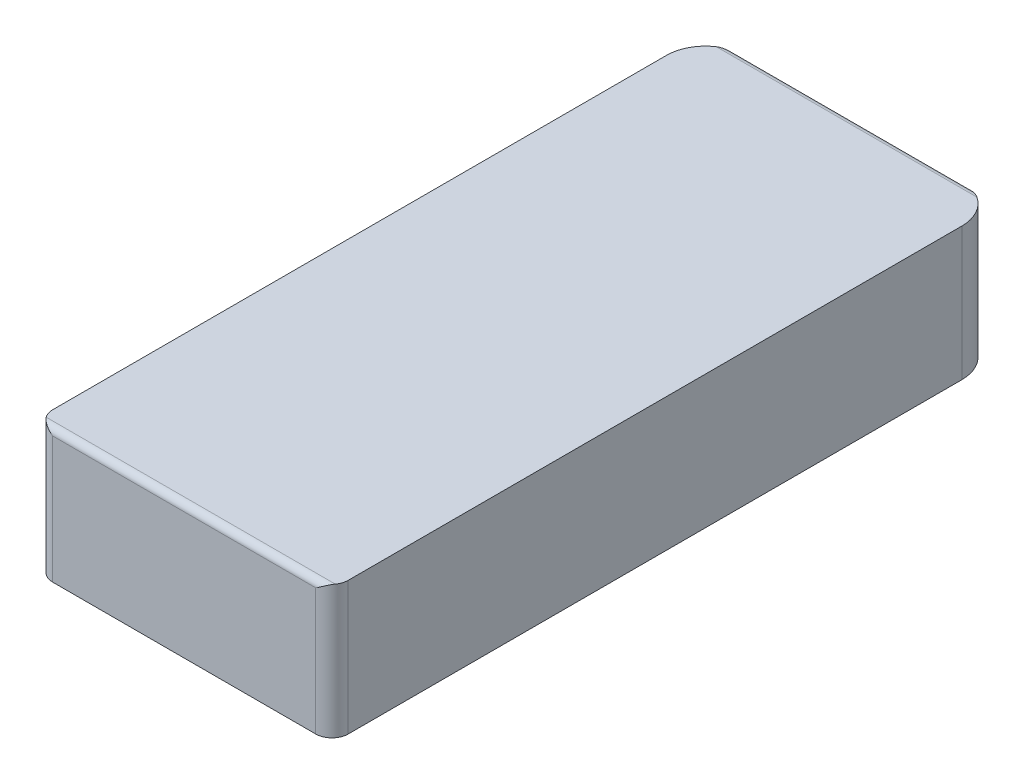
ISO-10303-21;
HEADER;
FILE_DESCRIPTION(('STEP AP214'),'2;1');
FILE_NAME('part.step','',(''),(''),'','','');
FILE_SCHEMA(('AUTOMOTIVE_DESIGN { 1 0 10303 214 1 1 1 1 }'));
ENDSEC;
DATA;
#1=APPLICATION_CONTEXT('core data for automotive mechanical design processes');
#2=APPLICATION_PROTOCOL_DEFINITION('international standard','automotive_design',2000,#1);
#3=PRODUCT_CONTEXT('',#1,'mechanical');
#4=PRODUCT('Part','Part','',(#3));
#5=PRODUCT_RELATED_PRODUCT_CATEGORY('part','',(#4));
#6=PRODUCT_DEFINITION_FORMATION('','',#4);
#7=PRODUCT_DEFINITION_CONTEXT('part definition',#1,'design');
#8=PRODUCT_DEFINITION('design','',#6,#7);
#9=PRODUCT_DEFINITION_SHAPE('','',#8);
#10=(LENGTH_UNIT() NAMED_UNIT(*) SI_UNIT(.MILLI.,.METRE.));
#11=(NAMED_UNIT(*) PLANE_ANGLE_UNIT() SI_UNIT($,.RADIAN.));
#12=(NAMED_UNIT(*) SI_UNIT($,.STERADIAN.) SOLID_ANGLE_UNIT());
#13=UNCERTAINTY_MEASURE_WITH_UNIT(LENGTH_MEASURE(1.E-05),#10,'distance_accuracy_value','');
#14=(GEOMETRIC_REPRESENTATION_CONTEXT(3) GLOBAL_UNCERTAINTY_ASSIGNED_CONTEXT((#13)) GLOBAL_UNIT_ASSIGNED_CONTEXT((#10,
#11,#12)) REPRESENTATION_CONTEXT('',''));
#15=CARTESIAN_POINT('',(0.,0.,0.));
#16=DIRECTION('',(0.,0.,1.));
#17=DIRECTION('',(1.,0.,0.));
#18=AXIS2_PLACEMENT_3D('',#15,#16,#17);
#19=CARTESIAN_POINT('',(-45.5,225.136989380863,103.));
#20=DIRECTION('',(0.,0.,1.));
#21=DIRECTION('',(1.,0.,0.));
#22=AXIS2_PLACEMENT_3D('',#19,#20,#21);
#23=PLANE('',#22);
#24=DIRECTION('',(0.,1.,0.));
#25=VECTOR('',#24,1.);
#26=CARTESIAN_POINT('',(-40.5,225.136989380863,103.));
#27=LINE('',#26,#25);
#28=CARTESIAN_POINT('',(-40.5,245.136989380863,103.));
#29=VERTEX_POINT('',#28);
#30=CARTESIAN_POINT('',(-40.5,284.136989380863,103.));
#31=VERTEX_POINT('',#30);
#32=EDGE_CURVE('E167',#29,#31,#27,.T.);
#33=ORIENTED_EDGE('',*,*,#32,.F.);
#34=DIRECTION('',(1.,0.,0.));
#35=VECTOR('',#34,1.);
#36=CARTESIAN_POINT('',(-45.5,245.136989380863,103.));
#37=LINE('',#36,#35);
#38=CARTESIAN_POINT('',(40.5,245.136989380863,103.));
#39=VERTEX_POINT('',#38);
#40=EDGE_CURVE('E156',#29,#39,#37,.T.);
#41=ORIENTED_EDGE('',*,*,#40,.T.);
#42=DIRECTION('',(0.,-1.,0.));
#43=VECTOR('',#42,1.);
#44=CARTESIAN_POINT('',(40.5,225.136989380863,103.));
#45=LINE('',#44,#43);
#46=CARTESIAN_POINT('',(40.5,284.136989380863,103.));
#47=VERTEX_POINT('',#46);
#48=EDGE_CURVE('E165',#47,#39,#45,.T.);
#49=ORIENTED_EDGE('',*,*,#48,.F.);
#50=DIRECTION('',(1.,0.,0.));
#51=VECTOR('',#50,1.);
#52=CARTESIAN_POINT('',(-22.75,284.136989380863,103.));
#53=LINE('',#52,#51);
#54=EDGE_CURVE('E244',#31,#47,#53,.T.);
#55=ORIENTED_EDGE('',*,*,#54,.F.);
#56=EDGE_LOOP('',(#33,#41,#49,#55));
#57=FACE_BOUND('',#56,.T.);
#58=ADVANCED_FACE('F64',(#57),#23,.T.);
#59=CARTESIAN_POINT('',(-33.5,225.136989380863,-91.));
#60=DIRECTION('',(0.,1.,0.));
#61=DIRECTION('',(-0.707106781186547,0.,-0.707106781186548));
#62=AXIS2_PLACEMENT_3D('',#59,#60,#61);
#63=CYLINDRICAL_SURFACE('',#62,12.);
#64=DIRECTION('',(0.,-1.,0.));
#65=VECTOR('',#64,1.);
#66=CARTESIAN_POINT('',(-33.5,225.136989380863,-103.));
#67=LINE('',#66,#65);
#68=CARTESIAN_POINT('',(-33.5,284.136989380863,-103.));
#69=VERTEX_POINT('',#68);
#70=CARTESIAN_POINT('',(-33.5,245.136989380863,-103.));
#71=VERTEX_POINT('',#70);
#72=EDGE_CURVE('E73',#69,#71,#67,.T.);
#73=ORIENTED_EDGE('',*,*,#72,.T.);
#74=CARTESIAN_POINT('',(-33.5,245.136989380863,-91.));
#75=DIRECTION('',(0.,-1.,0.));
#76=DIRECTION('',(0.,0.,-1.));
#77=AXIS2_PLACEMENT_3D('',#74,#75,#76);
#78=CIRCLE('',#77,12.);
#79=CARTESIAN_POINT('',(-45.5,245.136989380863,-91.));
#80=VERTEX_POINT('',#79);
#81=EDGE_CURVE('E169',#71,#80,#78,.F.);
#82=ORIENTED_EDGE('',*,*,#81,.T.);
#83=DIRECTION('',(0.,1.,0.));
#84=VECTOR('',#83,1.);
#85=CARTESIAN_POINT('',(-45.5,225.136989380863,-91.));
#86=LINE('',#85,#84);
#87=CARTESIAN_POINT('',(-45.5,286.136989380863,-91.));
#88=VERTEX_POINT('',#87);
#89=EDGE_CURVE('E306',#80,#88,#86,.T.);
#90=ORIENTED_EDGE('',*,*,#89,.T.);
#91=CARTESIAN_POINT('',(-33.5,286.136989380863,-91.));
#92=DIRECTION('',(0.,-1.,0.));
#93=DIRECTION('',(-0.707106781186547,0.,-0.707106781186548));
#94=AXIS2_PLACEMENT_3D('',#91,#92,#93);
#95=CIRCLE('',#94,12.);
#96=CARTESIAN_POINT('',(-40.1332495807107,286.136989380863,-101.));
#97=VERTEX_POINT('',#96);
#98=EDGE_CURVE('E278',#88,#97,#95,.T.);
#99=ORIENTED_EDGE('',*,*,#98,.T.);
#100=CARTESIAN_POINT('',(-40.1332495807108,286.136989380863,-101.));
#101=CARTESIAN_POINT('',(-40.0640660615252,286.136981490519,-101.045892902104));
#102=CARTESIAN_POINT('',(-39.9944151054252,286.135348460359,-101.091058606076));
#103=CARTESIAN_POINT('',(-39.8516976404154,286.129023031275,-101.181518831641));
#104=CARTESIAN_POINT('',(-39.7785999525268,286.124219935418,-101.22675657606));
#105=CARTESIAN_POINT('',(-39.6289254182644,286.1115594262,-101.317179863077));
#106=CARTESIAN_POINT('',(-39.5523195489806,286.103596092492,-101.362302189319));
#107=CARTESIAN_POINT('',(-39.3955632544034,286.084608021319,-101.452310634221));
#108=CARTESIAN_POINT('',(-39.3153856193308,286.073482020822,-101.497127830542));
#109=CARTESIAN_POINT('',(-39.1514273669803,286.048164579711,-101.586330400301));
#110=CARTESIAN_POINT('',(-39.0676213311579,286.033876810298,-101.630641509362));
#111=CARTESIAN_POINT('',(-38.8963533460769,286.002230751732,-101.718627112488));
#112=CARTESIAN_POINT('',(-38.8088676896653,285.984781055523,-101.762222406962));
#113=CARTESIAN_POINT('',(-38.6301944625209,285.946806369114,-101.848561779333));
#114=CARTESIAN_POINT('',(-38.5389848716456,285.926194833031,-101.89122205537));
#115=CARTESIAN_POINT('',(-38.3528254234858,285.88189160314,-101.975467249203));
#116=CARTESIAN_POINT('',(-38.2578552377493,285.858118080595,-102.016964057299));
#117=CARTESIAN_POINT('',(-38.0641445868376,285.807486621185,-102.098648789029));
#118=CARTESIAN_POINT('',(-37.9653855165406,285.780551406708,-102.138744550022));
#119=CARTESIAN_POINT('',(-37.7640772246196,285.723590789652,-102.217384202027));
#120=CARTESIAN_POINT('',(-37.6615112146583,285.693492393582,-102.255832089284));
#121=CARTESIAN_POINT('',(-37.4525766689266,285.630206524758,-102.330924881534));
#122=CARTESIAN_POINT('',(-37.3461931650924,285.596950338904,-102.367470161538));
#123=CARTESIAN_POINT('',(-37.1296337483279,285.52732409388,-102.438494515461));
#124=CARTESIAN_POINT('',(-37.019445174009,285.490888524279,-102.472870401174));
#125=CARTESIAN_POINT('',(-36.734529193923,285.394420700238,-102.557290519115));
#126=CARTESIAN_POINT('',(-36.5595275482708,285.332986103252,-102.60482360727));
#127=CARTESIAN_POINT('',(-36.1929773609957,285.20096306721,-102.695583097779));
#128=CARTESIAN_POINT('',(-36.0013566178568,285.130048339706,-102.738037305619));
#129=CARTESIAN_POINT('',(-35.6014765132288,284.979114945085,-102.816456644135));
#130=CARTESIAN_POINT('',(-35.3931545181868,284.898828883423,-102.851592236043));
#131=CARTESIAN_POINT('',(-35.0453089725341,284.761964271033,-102.900919176317));
#132=CARTESIAN_POINT('',(-34.905837709954,284.706335013991,-102.918193558371));
#133=CARTESIAN_POINT('',(-34.5792700093998,284.575353830998,-102.95284542078));
#134=CARTESIAN_POINT('',(-34.3920775658168,284.499716846195,-102.968267532921));
#135=CARTESIAN_POINT('',(-33.9699751245849,284.328498418316,-102.993098514436));
#136=CARTESIAN_POINT('',(-33.7349941165346,284.232720090892,-102.999993145218));
#137=CARTESIAN_POINT('',(-33.5,284.136989380863,-103.));
#138=B_SPLINE_CURVE_WITH_KNOTS('',3,(#100,#101,#102,#103,#104,#105,#106,#107,#108,#109,#110,
#111,#112,#113,#114,#115,#116,#117,#118,#119,#120,#121,#122,#123,#124,#125,#126,#127,#128,#129,
#130,#131,#132,#133,#134,#135,#136,#137),.UNSPECIFIED.,.F.,.F.,(4,2,2,2,2,2,2,2,2,2,2,2,2,2,2,2,
2,2,4),(0.,0.249025458694375,0.507242479934915,0.774964373884721,1.05247225464372,
1.34001853196877,1.63783008810929,1.94611113717128,2.26504577853786,2.59480026415555,
2.9355250037112,3.28735633322867,3.65041807238592,4.22457554270914,4.85038820217259,
5.52807293815943,5.98143807420426,6.58869417425348,7.34983797150393),.UNSPECIFIED.);
#139=EDGE_CURVE('E312',#97,#69,#138,.T.);
#140=ORIENTED_EDGE('',*,*,#139,.T.);
#141=EDGE_LOOP('',(#73,#82,#90,#99,#140));
#142=FACE_BOUND('',#141,.T.);
#143=ADVANCED_FACE('F323',(#142),#63,.T.);
#144=CARTESIAN_POINT('',(45.5,225.136989380863,-103.));
#145=DIRECTION('',(0.,0.,-1.));
#146=DIRECTION('',(0.,-1.,0.));
#147=AXIS2_PLACEMENT_3D('',#144,#145,#146);
#148=PLANE('',#147);
#149=DIRECTION('',(0.,1.,0.));
#150=VECTOR('',#149,1.);
#151=CARTESIAN_POINT('',(33.5,225.136989380863,-103.));
#152=LINE('',#151,#150);
#153=CARTESIAN_POINT('',(33.5,245.136989380863,-103.));
#154=VERTEX_POINT('',#153);
#155=CARTESIAN_POINT('',(33.5,284.136989380863,-103.));
#156=VERTEX_POINT('',#155);
#157=EDGE_CURVE('E67',#154,#156,#152,.T.);
#158=ORIENTED_EDGE('',*,*,#157,.F.);
#159=DIRECTION('',(-1.,0.,0.));
#160=VECTOR('',#159,1.);
#161=CARTESIAN_POINT('',(45.5,245.136989380863,-103.));
#162=LINE('',#161,#160);
#163=EDGE_CURVE('E490',#154,#71,#162,.T.);
#164=ORIENTED_EDGE('',*,*,#163,.T.);
#165=ORIENTED_EDGE('',*,*,#72,.F.);
#166=DIRECTION('',(-1.,0.,0.));
#167=VECTOR('',#166,1.);
#168=CARTESIAN_POINT('',(22.75,284.136989380863,-103.));
#169=LINE('',#168,#167);
#170=EDGE_CURVE('E474',#156,#69,#169,.T.);
#171=ORIENTED_EDGE('',*,*,#170,.F.);
#172=EDGE_LOOP('',(#158,#164,#165,#171));
#173=FACE_BOUND('',#172,.T.);
#174=ADVANCED_FACE('F331',(#173),#148,.T.);
#175=CARTESIAN_POINT('',(33.5,225.136989380863,-91.));
#176=DIRECTION('',(0.,1.,0.));
#177=DIRECTION('',(0.707106781186547,0.,-0.707106781186548));
#178=AXIS2_PLACEMENT_3D('',#175,#176,#177);
#179=CYLINDRICAL_SURFACE('',#178,12.);
#180=DIRECTION('',(0.,-1.,0.));
#181=VECTOR('',#180,1.);
#182=CARTESIAN_POINT('',(45.5,225.136989380863,-91.));
#183=LINE('',#182,#181);
#184=CARTESIAN_POINT('',(45.5,286.136989380863,-91.));
#185=VERTEX_POINT('',#184);
#186=CARTESIAN_POINT('',(45.5,245.136989380863,-91.));
#187=VERTEX_POINT('',#186);
#188=EDGE_CURVE('E267',#185,#187,#183,.T.);
#189=ORIENTED_EDGE('',*,*,#188,.T.);
#190=CARTESIAN_POINT('',(33.5,245.136989380863,-91.));
#191=DIRECTION('',(0.,-1.,0.));
#192=DIRECTION('',(0.,0.,-1.));
#193=AXIS2_PLACEMENT_3D('',#190,#191,#192);
#194=CIRCLE('',#193,12.);
#195=EDGE_CURVE('E492',#187,#154,#194,.F.);
#196=ORIENTED_EDGE('',*,*,#195,.T.);
#197=ORIENTED_EDGE('',*,*,#157,.T.);
#198=CARTESIAN_POINT('',(33.5,284.136989380863,-103.));
#199=CARTESIAN_POINT('',(33.7401094530998,284.23494944069,-102.999998716084));
#200=CARTESIAN_POINT('',(33.9803393195562,284.33261450187,-102.992793838593));
#201=CARTESIAN_POINT('',(34.4261958576606,284.512810742344,-102.965979814008));
#202=CARTESIAN_POINT('',(34.6318700469951,284.595513311926,-102.948286827056));
#203=CARTESIAN_POINT('',(35.008411391332,284.745880453222,-102.906064804819));
#204=CARTESIAN_POINT('',(35.1793763878626,284.813757717108,-102.883162864799));
#205=CARTESIAN_POINT('',(35.4868332348865,284.934190705427,-102.835186442318));
#206=CARTESIAN_POINT('',(35.6233971581784,284.987101241564,-102.811457176695));
#207=CARTESIAN_POINT('',(35.9594581588196,285.114938751707,-102.747013545156));
#208=CARTESIAN_POINT('',(36.1588608534857,285.188735068416,-102.703518554492));
#209=CARTESIAN_POINT('',(36.5419862558287,285.326847561947,-102.609579971509));
#210=CARTESIAN_POINT('',(36.7257840979258,285.391461850709,-102.559882191047));
#211=CARTESIAN_POINT('',(37.0194370846648,285.490884523976,-102.472872487978));
#212=CARTESIAN_POINT('',(37.1296160865643,285.527323179489,-102.438499949701));
#213=CARTESIAN_POINT('',(37.3461590478732,285.596951605789,-102.36748169793));
#214=CARTESIAN_POINT('',(37.452535626946,285.630206996776,-102.3309391404));
#215=CARTESIAN_POINT('',(37.6614578401886,285.693492310769,-102.255851748738));
#216=CARTESIAN_POINT('',(37.7640184350101,285.723590901885,-102.217406488113));
#217=CARTESIAN_POINT('',(37.9653176617868,285.780551662648,-102.138771714345));
#218=CARTESIAN_POINT('',(38.0640730658859,285.807486817162,-102.098678161167));
#219=CARTESIAN_POINT('',(38.2577780271381,285.858118241809,-102.016997376509));
#220=CARTESIAN_POINT('',(38.3527461758939,285.881891766768,-101.975502264463));
#221=CARTESIAN_POINT('',(38.53890315913,285.926195007085,-101.891259852482));
#222=CARTESIAN_POINT('',(38.6301123083965,285.946806526571,-101.848600621401));
#223=CARTESIAN_POINT('',(38.8087862004782,285.984781211524,-101.762262611568));
#224=CARTESIAN_POINT('',(38.8962729504379,286.002230892327,-101.7186675957));
#225=CARTESIAN_POINT('',(39.0675446136398,286.033876952125,-101.630681711044));
#226=CARTESIAN_POINT('',(39.1513532214743,286.048164701736,-101.586370004905));
#227=CARTESIAN_POINT('',(39.3153180487215,286.073482142772,-101.497165301225));
#228=CARTESIAN_POINT('',(39.395499674482,286.084608119575,-101.45234653323));
#229=CARTESIAN_POINT('',(39.5522653216495,286.103596191344,-101.362333912636));
#230=CARTESIAN_POINT('',(39.6288765407107,286.111559497998,-101.317208949902));
#231=CARTESIAN_POINT('',(39.7785630849194,286.124220004794,-101.226779274577));
#232=CARTESIAN_POINT('',(39.8516674206298,286.129023065385,-101.181537748493));
#233=CARTESIAN_POINT('',(39.9943994378409,286.135348501503,-101.091068766325));
#234=CARTESIAN_POINT('',(40.0640582848589,286.136981503671,-101.045898060972));
#235=CARTESIAN_POINT('',(40.1332495807108,286.136989380863,-101.));
#236=B_SPLINE_CURVE_WITH_KNOTS('',3,(#198,#199,#200,#201,#202,#203,#204,#205,#206,#207,#208,
#209,#210,#211,#212,#213,#214,#215,#216,#217,#218,#219,#220,#221,#222,#223,#224,#225,#226,#227,
#228,#229,#230,#231,#232,#233,#234,#235),.UNSPECIFIED.,.F.,.F.,(4,2,2,2,2,2,2,2,2,2,2,2,2,2,2,2,
2,2,4),(0.,0.777862498095459,1.44475866814504,2.00070027567319,2.44571719615744,
3.09647781862858,3.69940174005696,4.06243676325478,4.41424611248917,4.75495366157438,
5.08469580120271,5.40362299547553,5.71190154942958,6.00971561278099,6.29726944531855,
6.57478996785578,6.84252961841562,7.10076952502399,7.34982299236482),.UNSPECIFIED.);
#237=CARTESIAN_POINT('',(40.1332495807109,286.136989380863,-101.));
#238=VERTEX_POINT('',#237);
#239=EDGE_CURVE('E471',#156,#238,#236,.T.);
#240=ORIENTED_EDGE('',*,*,#239,.T.);
#241=CARTESIAN_POINT('',(33.5,286.136989380863,-91.));
#242=DIRECTION('',(0.,-1.,0.));
#243=DIRECTION('',(0.707106781186547,0.,-0.707106781186548));
#244=AXIS2_PLACEMENT_3D('',#241,#242,#243);
#245=CIRCLE('',#244,12.);
#246=EDGE_CURVE('E309',#238,#185,#245,.T.);
#247=ORIENTED_EDGE('',*,*,#246,.T.);
#248=EDGE_LOOP('',(#189,#196,#197,#240,#247));
#249=FACE_BOUND('',#248,.T.);
#250=ADVANCED_FACE('F217',(#249),#179,.T.);
#251=CARTESIAN_POINT('',(-45.5,225.136989380863,-103.));
#252=DIRECTION('',(-1.,0.,0.));
#253=DIRECTION('',(0.,0.,1.));
#254=AXIS2_PLACEMENT_3D('',#251,#252,#253);
#255=PLANE('',#254);
#256=ORIENTED_EDGE('',*,*,#89,.F.);
#257=DIRECTION('',(0.,0.,1.));
#258=VECTOR('',#257,1.);
#259=CARTESIAN_POINT('',(-45.5,245.136989380863,-103.));
#260=LINE('',#259,#258);
#261=CARTESIAN_POINT('',(-45.5,245.136989380863,98.));
#262=VERTEX_POINT('',#261);
#263=EDGE_CURVE('E185',#80,#262,#260,.T.);
#264=ORIENTED_EDGE('',*,*,#263,.T.);
#265=DIRECTION('',(0.,-1.,0.));
#266=VECTOR('',#265,1.);
#267=CARTESIAN_POINT('',(-45.5,225.136989380863,98.));
#268=LINE('',#267,#266);
#269=CARTESIAN_POINT('',(-45.5,286.136989380863,98.));
#270=VERTEX_POINT('',#269);
#271=EDGE_CURVE('E271',#270,#262,#268,.T.);
#272=ORIENTED_EDGE('',*,*,#271,.F.);
#273=DIRECTION('',(0.,0.,1.));
#274=VECTOR('',#273,1.);
#275=CARTESIAN_POINT('',(-45.5,286.136989380863,-103.));
#276=LINE('',#275,#274);
#277=EDGE_CURVE('E303',#88,#270,#276,.T.);
#278=ORIENTED_EDGE('',*,*,#277,.F.);
#279=EDGE_LOOP('',(#256,#264,#272,#278));
#280=FACE_BOUND('',#279,.T.);
#281=ADVANCED_FACE('F214',(#280),#255,.T.);
#282=CARTESIAN_POINT('',(-40.5,225.136989380863,98.));
#283=DIRECTION('',(0.,1.,0.));
#284=DIRECTION('',(-0.707106781186548,0.,0.707106781186548));
#285=AXIS2_PLACEMENT_3D('',#282,#283,#284);
#286=CYLINDRICAL_SURFACE('',#285,5.);
#287=ORIENTED_EDGE('',*,*,#271,.T.);
#288=CARTESIAN_POINT('',(-40.5,245.136989380863,98.));
#289=DIRECTION('',(0.,-1.,0.));
#290=DIRECTION('',(0.,0.,-1.));
#291=AXIS2_PLACEMENT_3D('',#288,#289,#290);
#292=CIRCLE('',#291,5.);
#293=EDGE_CURVE('E168',#262,#29,#292,.F.);
#294=ORIENTED_EDGE('',*,*,#293,.T.);
#295=ORIENTED_EDGE('',*,*,#32,.T.);
#296=CARTESIAN_POINT('',(-40.5,284.136989380863,103.));
#297=CARTESIAN_POINT('',(-40.6158305754452,284.210218072088,102.999999645239));
#298=CARTESIAN_POINT('',(-40.7317290731438,284.283338152267,102.995975199106));
#299=CARTESIAN_POINT('',(-40.9467855632774,284.418730577207,102.980992805968));
#300=CARTESIAN_POINT('',(-41.045979155693,284.48106610186,102.971102844879));
#301=CARTESIAN_POINT('',(-41.2274956462086,284.594923319904,102.947492563785));
#302=CARTESIAN_POINT('',(-41.3098875877025,284.646523552346,102.93467977499));
#303=CARTESIAN_POINT('',(-41.4580025928141,284.738812149824,102.907821917608));
#304=CARTESIAN_POINT('',(-41.523782397935,284.779630011076,102.894528514034));
#305=CARTESIAN_POINT('',(-41.6897777324085,284.881806216998,102.857466129272));
#306=CARTESIAN_POINT('',(-41.7898971996534,284.942669373885,102.831865925429));
#307=CARTESIAN_POINT('',(-41.9832046748427,285.058944657859,102.775940542255));
#308=CARTESIAN_POINT('',(-42.0764413502316,285.114462223271,102.746001220813));
#309=CARTESIAN_POINT('',(-42.2560008079269,285.219959053878,102.682406422877));
#310=CARTESIAN_POINT('',(-42.342379230857,285.270063799256,102.649118752507));
#311=CARTESIAN_POINT('',(-42.4689953585516,285.342325948789,102.596194673444));
#312=CARTESIAN_POINT('',(-42.5096095705447,285.365323822425,102.578585056229));
#313=CARTESIAN_POINT('',(-42.589140385056,285.409948030427,102.542832125156));
#314=CARTESIAN_POINT('',(-42.6280651235887,285.431593854679,102.52473134541));
#315=CARTESIAN_POINT('',(-42.7154437203764,285.479680926663,102.482712685793));
#316=CARTESIAN_POINT('',(-42.7638339664938,285.505960223055,102.458476101708));
#317=CARTESIAN_POINT('',(-42.8589765182237,285.556881081032,102.408858624422));
#318=CARTESIAN_POINT('',(-42.9057390923855,285.581547328564,102.38352276591));
#319=CARTESIAN_POINT('',(-42.9976207020062,285.629241581835,102.331812261417));
#320=CARTESIAN_POINT('',(-43.0427509552145,285.652295462894,102.305481458451));
#321=CARTESIAN_POINT('',(-43.131366937333,285.69676357556,102.25188413635));
#322=CARTESIAN_POINT('',(-43.1748647789107,285.718204937673,102.224660190318));
#323=CARTESIAN_POINT('',(-43.2602197374645,285.759446779626,102.169376869615));
#324=CARTESIAN_POINT('',(-43.3020897971569,285.779275678144,102.141358717949));
#325=CARTESIAN_POINT('',(-43.3841973458021,285.817291270267,102.084584410959));
#326=CARTESIAN_POINT('',(-43.4244485471861,285.835507702306,102.055868039311));
#327=CARTESIAN_POINT('',(-43.5033305819342,285.870297010326,101.997791774117));
#328=CARTESIAN_POINT('',(-43.5419758381779,285.886900963318,101.968470126051));
#329=CARTESIAN_POINT('',(-43.6176620318522,285.918463996109,101.909274669343));
#330=CARTESIAN_POINT('',(-43.6547180411371,285.933455493734,101.87943746166));
#331=CARTESIAN_POINT('',(-43.7272449582961,285.961792109183,101.819299445705));
#332=CARTESIAN_POINT('',(-43.7627315354477,285.975170974607,101.789033466568));
#333=CARTESIAN_POINT('',(-43.8321430694572,286.000281526382,101.728122284878));
#334=CARTESIAN_POINT('',(-43.8660842022783,286.012048230213,101.6975100378));
#335=CARTESIAN_POINT('',(-43.922874235959,286.030780193857,101.644849741749));
#336=CARTESIAN_POINT('',(-43.945886424154,286.038099716344,101.623102813493));
#337=CARTESIAN_POINT('',(-43.9911594198509,286.05192521637,101.57949361663));
#338=CARTESIAN_POINT('',(-44.0134261609339,286.058444154283,101.557641648392));
#339=CARTESIAN_POINT('',(-44.046608299093,286.067702292861,101.524459514045));
#340=CARTESIAN_POINT('',(-44.0576427955133,286.070704164613,101.513320940969));
#341=CARTESIAN_POINT('',(-44.0795599627894,286.076506955907,101.490987504276));
#342=CARTESIAN_POINT('',(-44.090443152881,286.079309031601,101.479793448636));
#343=CARTESIAN_POINT('',(-44.1375467528032,286.091085116275,101.430886956163));
#344=CARTESIAN_POINT('',(-44.1733462723652,286.099126407536,101.392534932926));
#345=CARTESIAN_POINT('',(-44.2432051472109,286.112873259002,101.315278876498));
#346=CARTESIAN_POINT('',(-44.2772849489603,286.118622078597,101.276400977721));
#347=CARTESIAN_POINT('',(-44.343728017348,286.127786172414,101.198177183421));
#348=CARTESIAN_POINT('',(-44.3761113791883,286.131242664199,101.158853264842));
#349=CARTESIAN_POINT('',(-44.4391850690561,286.135825717491,101.079827842445));
#350=CARTESIAN_POINT('',(-44.4698947842558,286.136990756225,101.040144019528));
#351=CARTESIAN_POINT('',(-44.5,286.136989380863,101.));
#352=B_SPLINE_CURVE_WITH_KNOTS('',3,(#296,#297,#298,#299,#300,#301,#302,#303,#304,#305,#306,
#307,#308,#309,#310,#311,#312,#313,#314,#315,#316,#317,#318,#319,#320,#321,#322,#323,#324,#325,
#326,#327,#328,#329,#330,#331,#332,#333,#334,#335,#336,#337,#338,#339,#340,#341,#342,#343,#344,
#345,#346,#347,#348,#349,#350,#351),.UNSPECIFIED.,.F.,.F.,(4,2,2,2,2,2,2,2,2,2,2,2,2,2,2,2,2,2,
2,2,2,2,2,2,2,2,2,4),(0.,0.411046449074108,0.763608286390202,1.05768630460155,1.29328730105243,
1.65287917429701,1.99042718482509,2.30604511674894,2.45568560637737,2.5998977054133,
2.78035198495231,2.9561974837944,3.12749285793628,3.29430156424795,3.45669232024786,
3.61473960706515,3.76852421771932,3.91813385211789,4.06366375906934,4.20521742401959,
4.30269743027993,4.39829875063513,4.44618814904781,4.49377311180675,4.65292580861667,
4.80891430583422,4.96201594884615,5.11252404342972),.UNSPECIFIED.);
#353=CARTESIAN_POINT('',(-44.5,286.136989380863,101.));
#354=VERTEX_POINT('',#353);
#355=EDGE_CURVE('E240',#31,#354,#352,.T.);
#356=ORIENTED_EDGE('',*,*,#355,.T.);
#357=CARTESIAN_POINT('',(-40.5,286.136989380863,98.));
#358=DIRECTION('',(0.,-1.,0.));
#359=DIRECTION('',(-0.707106781186548,0.,0.707106781186548));
#360=AXIS2_PLACEMENT_3D('',#357,#358,#359);
#361=CIRCLE('',#360,5.);
#362=EDGE_CURVE('E280',#354,#270,#361,.T.);
#363=ORIENTED_EDGE('',*,*,#362,.T.);
#364=EDGE_LOOP('',(#287,#294,#295,#356,#363));
#365=FACE_BOUND('',#364,.T.);
#366=ADVANCED_FACE('F212',(#365),#286,.T.);
#367=CARTESIAN_POINT('',(45.5,225.136989380863,103.));
#368=DIRECTION('',(1.,0.,0.));
#369=DIRECTION('',(0.,1.,0.));
#370=AXIS2_PLACEMENT_3D('',#367,#368,#369);
#371=PLANE('',#370);
#372=DIRECTION('',(0.,1.,0.));
#373=VECTOR('',#372,1.);
#374=CARTESIAN_POINT('',(45.5,225.136989380863,98.));
#375=LINE('',#374,#373);
#376=CARTESIAN_POINT('',(45.5,245.136989380863,98.));
#377=VERTEX_POINT('',#376);
#378=CARTESIAN_POINT('',(45.5,286.136989380863,98.));
#379=VERTEX_POINT('',#378);
#380=EDGE_CURVE('E177',#377,#379,#375,.T.);
#381=ORIENTED_EDGE('',*,*,#380,.F.);
#382=DIRECTION('',(0.,0.,-1.));
#383=VECTOR('',#382,1.);
#384=CARTESIAN_POINT('',(45.5,245.136989380863,103.));
#385=LINE('',#384,#383);
#386=EDGE_CURVE('E81',#377,#187,#385,.T.);
#387=ORIENTED_EDGE('',*,*,#386,.T.);
#388=ORIENTED_EDGE('',*,*,#188,.F.);
#389=DIRECTION('',(0.,0.,-1.));
#390=VECTOR('',#389,1.);
#391=CARTESIAN_POINT('',(45.5,286.136989380863,103.));
#392=LINE('',#391,#390);
#393=EDGE_CURVE('E283',#379,#185,#392,.T.);
#394=ORIENTED_EDGE('',*,*,#393,.F.);
#395=EDGE_LOOP('',(#381,#387,#388,#394));
#396=FACE_BOUND('',#395,.T.);
#397=ADVANCED_FACE('F207',(#396),#371,.T.);
#398=CARTESIAN_POINT('',(40.5,225.136989380863,98.));
#399=DIRECTION('',(0.,1.,0.));
#400=DIRECTION('',(0.707106781186548,0.,0.707106781186548));
#401=AXIS2_PLACEMENT_3D('',#398,#399,#400);
#402=CYLINDRICAL_SURFACE('',#401,5.);
#403=ORIENTED_EDGE('',*,*,#48,.T.);
#404=CARTESIAN_POINT('',(40.5,245.136989380863,98.));
#405=DIRECTION('',(0.,-1.,0.));
#406=DIRECTION('',(0.,0.,-1.));
#407=AXIS2_PLACEMENT_3D('',#404,#405,#406);
#408=CIRCLE('',#407,5.);
#409=EDGE_CURVE('E13',#39,#377,#408,.F.);
#410=ORIENTED_EDGE('',*,*,#409,.T.);
#411=ORIENTED_EDGE('',*,*,#380,.T.);
#412=CARTESIAN_POINT('',(40.5,286.136989380863,98.));
#413=DIRECTION('',(0.,-1.,0.));
#414=DIRECTION('',(0.707106781186548,0.,0.707106781186548));
#415=AXIS2_PLACEMENT_3D('',#412,#413,#414);
#416=CIRCLE('',#415,5.);
#417=CARTESIAN_POINT('',(44.5,286.136989380863,101.));
#418=VERTEX_POINT('',#417);
#419=EDGE_CURVE('E183',#379,#418,#416,.T.);
#420=ORIENTED_EDGE('',*,*,#419,.T.);
#421=CARTESIAN_POINT('',(44.5,286.136989380863,101.));
#422=CARTESIAN_POINT('',(44.4699089800959,286.136990731449,101.040125085696));
#423=CARTESIAN_POINT('',(44.4392140320585,286.135826677608,101.079790412193));
#424=CARTESIAN_POINT('',(44.3761706400243,286.131247544714,101.158780174133));
#425=CARTESIAN_POINT('',(44.3438028078479,286.127793985425,101.198086929051));
#426=CARTESIAN_POINT('',(44.2773915114899,286.118637650432,101.276277761392));
#427=CARTESIAN_POINT('',(44.2433279535367,286.112893661594,101.315139866524));
#428=CARTESIAN_POINT('',(44.1735021828849,286.099158639033,101.392365764386));
#429=CARTESIAN_POINT('',(44.1377195257,286.091124363419,101.430703432958));
#430=CARTESIAN_POINT('',(44.0906022006753,286.079349014609,101.479629541097));
#431=CARTESIAN_POINT('',(44.0796878395735,286.076539602494,101.490856581836));
#432=CARTESIAN_POINT('',(44.0577072905192,286.070721604999,101.513255836326));
#433=CARTESIAN_POINT('',(44.0466405776648,286.067711856384,101.524427234938));
#434=CARTESIAN_POINT('',(44.0141654646747,286.058649354636,101.556902345773));
#435=CARTESIAN_POINT('',(43.99264911561,286.052354336138,101.578031196307));
#436=CARTESIAN_POINT('',(43.9488954524278,286.039006962811,101.620229662528));
#437=CARTESIAN_POINT('',(43.9266523937009,286.031941750111,101.6412892253));
#438=CARTESIAN_POINT('',(43.8716973923671,286.013848079687,101.692375192531));
#439=CARTESIAN_POINT('',(43.8388316262845,286.002480194781,101.722116802769));
#440=CARTESIAN_POINT('',(43.7716003022522,285.97822608819,101.781361816));
#441=CARTESIAN_POINT('',(43.7372189429334,285.965305285517,101.810833046865));
#442=CARTESIAN_POINT('',(43.6669296321939,285.93794370256,101.86945879241));
#443=CARTESIAN_POINT('',(43.6310063185677,285.92346971882,101.898579361984));
#444=CARTESIAN_POINT('',(43.5576101077345,285.893000468671,101.956420860066));
#445=CARTESIAN_POINT('',(43.5201223691123,285.876973407402,101.985106163725));
#446=CARTESIAN_POINT('',(43.4435771546019,285.843396581695,102.041991056921));
#447=CARTESIAN_POINT('',(43.404505402595,285.825816425354,102.070153459222));
#448=CARTESIAN_POINT('',(43.3247754949519,285.789132026739,102.125903045598));
#449=CARTESIAN_POINT('',(43.284103684713,285.769998776589,102.153451575667));
#450=CARTESIAN_POINT('',(43.201160671197,285.730206826484,102.207880663069));
#451=CARTESIAN_POINT('',(43.1588764896982,285.709520469922,102.234721187678));
#452=CARTESIAN_POINT('',(43.07269980771,285.666620971797,102.287638305362));
#453=CARTESIAN_POINT('',(43.0287950647844,285.644381482872,102.313673564319));
#454=CARTESIAN_POINT('',(42.9393725028142,285.598374465413,102.364881207117));
#455=CARTESIAN_POINT('',(42.8938432333201,285.574581851589,102.390011027729));
#456=CARTESIAN_POINT('',(42.8011721277982,285.525467234809,102.439305632004));
#457=CARTESIAN_POINT('',(42.7540197132562,285.500121352487,102.463426679068));
#458=CARTESIAN_POINT('',(42.6508123207118,285.443928647587,102.514186883106));
#459=CARTESIAN_POINT('',(42.5946857491258,285.412914267824,102.540495389385));
#460=CARTESIAN_POINT('',(42.4803341149257,285.348867592563,102.591547999984));
#461=CARTESIAN_POINT('',(42.4220962443408,285.315802721231,102.616222413522));
#462=CARTESIAN_POINT('',(42.2948176158961,285.242662224796,102.667347911471));
#463=CARTESIAN_POINT('',(42.2257028750093,285.202388098054,102.693330834721));
#464=CARTESIAN_POINT('',(42.0687435929808,285.109984442811,102.748437837625));
#465=CARTESIAN_POINT('',(41.9807535251582,285.057522565884,102.776590940112));
#466=CARTESIAN_POINT('',(41.7973765304846,284.947099531332,102.829763376101));
#467=CARTESIAN_POINT('',(41.701939933774,284.889025220255,102.854376687195));
#468=CARTESIAN_POINT('',(41.5482212819453,284.794727538012,102.889250442337));
#469=CARTESIAN_POINT('',(41.4901043894279,284.758903117128,102.901346519784));
#470=CARTESIAN_POINT('',(41.4059054586195,284.706683391303,102.917320173928));
#471=CARTESIAN_POINT('',(41.3798599118448,284.690486124336,102.922046836104));
#472=CARTESIAN_POINT('',(41.2787953051648,284.627493755819,102.939562269857));
#473=CARTESIAN_POINT('',(41.2037001130838,284.580384397277,102.950814052652));
#474=CARTESIAN_POINT('',(41.0337752987764,284.473637315064,102.972342596786));
#475=CARTESIAN_POINT('',(40.9388714887055,284.413914620654,102.981612199743));
#476=CARTESIAN_POINT('',(40.7293278082734,284.281858952331,102.996057533443));
#477=CARTESIAN_POINT('',(40.6146437827711,284.209459020156,102.999998960922));
#478=CARTESIAN_POINT('',(40.5,284.136989380863,103.));
#479=B_SPLINE_CURVE_WITH_KNOTS('',3,(#421,#422,#423,#424,#425,#426,#427,#428,#429,#430,#431,
#432,#433,#434,#435,#436,#437,#438,#439,#440,#441,#442,#443,#444,#445,#446,#447,#448,#449,#450,
#451,#452,#453,#454,#455,#456,#457,#458,#459,#460,#461,#462,#463,#464,#465,#466,#467,#468,#469,
#470,#471,#472,#473,#474,#475,#476,#477,#478),.UNSPECIFIED.,.F.,.F.,(4,2,2,2,2,2,2,2,2,2,2,2,2,
2,2,2,2,2,2,2,2,2,2,2,2,2,2,2,4),(0.,0.150437138332635,0.303469074359024,0.459388734107856,
0.618473092229794,0.666195935654117,0.714225258580847,0.806630237352063,0.900925440679764,
1.03816977673854,1.17941174108578,1.32474798139646,1.47426720518632,1.62805088062029,
1.78617388374119,1.94870509262674,2.11570793027621,2.28724085886311,2.46335782847762,
2.67124397869762,2.88530578168209,3.13755065173022,3.45613325003909,3.79915287439166,
4.00712330065619,4.10022106708217,4.36822597365056,4.70563812307426,5.1124548322191),.UNSPECIFIED.);
#480=EDGE_CURVE('E174',#418,#47,#479,.T.);
#481=ORIENTED_EDGE('',*,*,#480,.T.);
#482=EDGE_LOOP('',(#403,#410,#411,#420,#481));
#483=FACE_BOUND('',#482,.T.);
#484=ADVANCED_FACE('F171',(#483),#402,.T.);
#485=CARTESIAN_POINT('',(22.75,284.136989380863,-101.));
#486=DIRECTION('',(-1.,0.,0.));
#487=DIRECTION('',(0.,0.707106781186554,-0.707106781186541));
#488=AXIS2_PLACEMENT_3D('',#485,#486,#487);
#489=CYLINDRICAL_SURFACE('',#488,2.);
#490=ORIENTED_EDGE('',*,*,#239,.F.);
#491=ORIENTED_EDGE('',*,*,#170,.T.);
#492=ORIENTED_EDGE('',*,*,#139,.F.);
#493=DIRECTION('',(1.,0.,0.));
#494=VECTOR('',#493,1.);
#495=CARTESIAN_POINT('',(22.75,286.136989380863,-101.));
#496=LINE('',#495,#494);
#497=EDGE_CURVE('E497',#97,#238,#496,.T.);
#498=ORIENTED_EDGE('',*,*,#497,.T.);
#499=EDGE_LOOP('',(#490,#491,#492,#498));
#500=FACE_BOUND('',#499,.T.);
#501=ADVANCED_FACE('F206',(#500),#489,.T.);
#502=CARTESIAN_POINT('',(-22.75,284.136989380863,101.));
#503=DIRECTION('',(1.,0.,0.));
#504=DIRECTION('',(0.,0.707106781186554,0.707106781186541));
#505=AXIS2_PLACEMENT_3D('',#502,#503,#504);
#506=CYLINDRICAL_SURFACE('',#505,2.);
#507=ORIENTED_EDGE('',*,*,#480,.F.);
#508=DIRECTION('',(-1.,0.,0.));
#509=VECTOR('',#508,1.);
#510=CARTESIAN_POINT('',(-22.75,286.136989380863,101.));
#511=LINE('',#510,#509);
#512=EDGE_CURVE('E275',#418,#354,#511,.T.);
#513=ORIENTED_EDGE('',*,*,#512,.T.);
#514=ORIENTED_EDGE('',*,*,#355,.F.);
#515=ORIENTED_EDGE('',*,*,#54,.T.);
#516=EDGE_LOOP('',(#507,#513,#514,#515));
#517=FACE_BOUND('',#516,.T.);
#518=ADVANCED_FACE('F246',(#517),#506,.T.);
#519=CARTESIAN_POINT('',(0.,286.136989380863,0.));
#520=DIRECTION('',(0.,1.,0.));
#521=DIRECTION('',(1.,0.,0.));
#522=AXIS2_PLACEMENT_3D('',#519,#520,#521);
#523=PLANE('',#522);
#524=ORIENTED_EDGE('',*,*,#419,.F.);
#525=ORIENTED_EDGE('',*,*,#393,.T.);
#526=ORIENTED_EDGE('',*,*,#246,.F.);
#527=ORIENTED_EDGE('',*,*,#497,.F.);
#528=ORIENTED_EDGE('',*,*,#98,.F.);
#529=ORIENTED_EDGE('',*,*,#277,.T.);
#530=ORIENTED_EDGE('',*,*,#362,.F.);
#531=ORIENTED_EDGE('',*,*,#512,.F.);
#532=EDGE_LOOP('',(#524,#525,#526,#527,#528,#529,#530,#531));
#533=FACE_BOUND('',#532,.T.);
#534=ADVANCED_FACE('F208',(#533),#523,.T.);
#535=CARTESIAN_POINT('',(40.5,245.136989380863,98.));
#536=DIRECTION('',(0.,-1.,0.));
#537=DIRECTION('',(0.,0.,-1.));
#538=AXIS2_PLACEMENT_3D('',#535,#536,#537);
#539=PLANE('',#538);
#540=ORIENTED_EDGE('',*,*,#81,.F.);
#541=ORIENTED_EDGE('',*,*,#163,.F.);
#542=ORIENTED_EDGE('',*,*,#195,.F.);
#543=ORIENTED_EDGE('',*,*,#386,.F.);
#544=ORIENTED_EDGE('',*,*,#409,.F.);
#545=ORIENTED_EDGE('',*,*,#40,.F.);
#546=ORIENTED_EDGE('',*,*,#293,.F.);
#547=ORIENTED_EDGE('',*,*,#263,.F.);
#548=EDGE_LOOP('',(#540,#541,#542,#543,#544,#545,#546,#547));
#549=FACE_BOUND('',#548,.T.);
#550=ADVANCED_FACE('F155',(#549),#539,.T.);
#551=CLOSED_SHELL('',(#58,#143,#174,#250,#281,#366,#397,#484,#501,#518,#534,#550));
#552=MANIFOLD_SOLID_BREP('B2',#551);
#553=ADVANCED_BREP_SHAPE_REPRESENTATION('',(#18,#552),#14);
#554=SHAPE_DEFINITION_REPRESENTATION(#9,#553);
ENDSEC;
END-ISO-10303-21;
